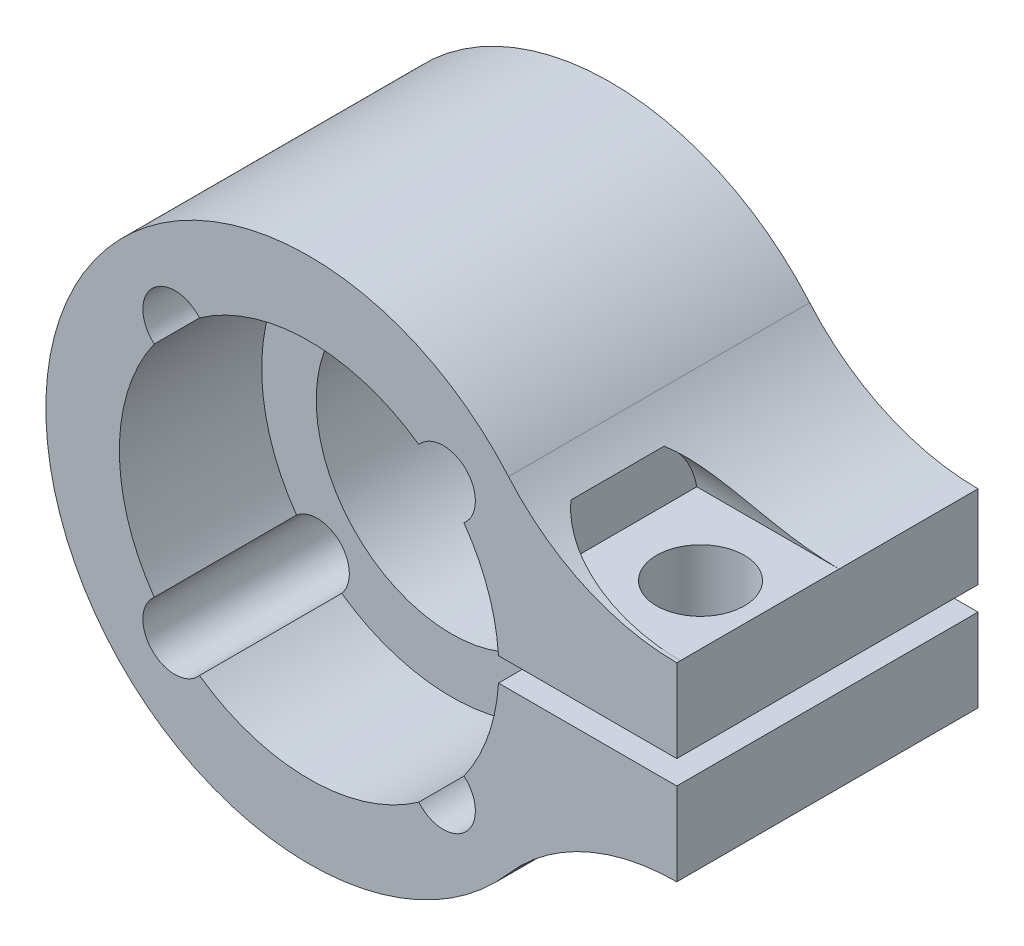
ISO-10303-21;
HEADER;
FILE_DESCRIPTION(('STEP AP214'),'2;1');
FILE_NAME('part.step','',(''),(''),'','','');
FILE_SCHEMA(('AUTOMOTIVE_DESIGN { 1 0 10303 214 1 1 1 1 }'));
ENDSEC;
DATA;
#1=APPLICATION_CONTEXT('core data for automotive mechanical design processes');
#2=APPLICATION_PROTOCOL_DEFINITION('international standard','automotive_design',2000,#1);
#3=PRODUCT_CONTEXT('',#1,'mechanical');
#4=PRODUCT('Part','Part','',(#3));
#5=PRODUCT_RELATED_PRODUCT_CATEGORY('part','',(#4));
#6=PRODUCT_DEFINITION_FORMATION('','',#4);
#7=PRODUCT_DEFINITION_CONTEXT('part definition',#1,'design');
#8=PRODUCT_DEFINITION('design','',#6,#7);
#9=PRODUCT_DEFINITION_SHAPE('','',#8);
#10=(LENGTH_UNIT() NAMED_UNIT(*) SI_UNIT(.MILLI.,.METRE.));
#11=(NAMED_UNIT(*) PLANE_ANGLE_UNIT() SI_UNIT($,.RADIAN.));
#12=(NAMED_UNIT(*) SI_UNIT($,.STERADIAN.) SOLID_ANGLE_UNIT());
#13=UNCERTAINTY_MEASURE_WITH_UNIT(LENGTH_MEASURE(1.E-05),#10,'distance_accuracy_value','');
#14=(GEOMETRIC_REPRESENTATION_CONTEXT(3) GLOBAL_UNCERTAINTY_ASSIGNED_CONTEXT((#13)) GLOBAL_UNIT_ASSIGNED_CONTEXT((#10,
#11,#12)) REPRESENTATION_CONTEXT('',''));
#15=CARTESIAN_POINT('',(0.,0.,0.));
#16=DIRECTION('',(0.,0.,1.));
#17=DIRECTION('',(1.,0.,0.));
#18=AXIS2_PLACEMENT_3D('',#15,#16,#17);
#19=CARTESIAN_POINT('',(15.5,4.,-0.153359893863698));
#20=DIRECTION('',(0.,-1.,0.));
#21=DIRECTION('',(0.,0.,-1.));
#22=AXIS2_PLACEMENT_3D('',#19,#20,#21);
#23=PLANE('',#22);
#24=CARTESIAN_POINT('',(13.,4.,-3.5));
#25=DIRECTION('',(0.,-1.,0.));
#26=DIRECTION('',(0.,0.,-1.));
#27=AXIS2_PLACEMENT_3D('',#24,#25,#26);
#28=CIRCLE('',#27,1.85);
#29=CARTESIAN_POINT('',(13.,4.,-5.35));
#30=VERTEX_POINT('',#29);
#31=EDGE_CURVE('E18',#30,#30,#28,.T.);
#32=ORIENTED_EDGE('',*,*,#31,.T.);
#33=EDGE_LOOP('',(#32));
#34=FACE_BOUND('',#33,.T.);
#35=DIRECTION('',(0.,0.,-1.));
#36=VECTOR('',#35,1.);
#37=CARTESIAN_POINT('',(9.5,4.,0.));
#38=LINE('',#37,#36);
#39=CARTESIAN_POINT('',(9.5,4.,-0.153359893863698));
#40=VERTEX_POINT('',#39);
#41=CARTESIAN_POINT('',(9.5,4.,-6.8466401061363));
#42=VERTEX_POINT('',#41);
#43=EDGE_CURVE('E157',#40,#42,#38,.T.);
#44=ORIENTED_EDGE('',*,*,#43,.F.);
#45=DIRECTION('',(1.,0.,0.));
#46=VECTOR('',#45,1.);
#47=CARTESIAN_POINT('',(15.5,4.,-0.153359893863699));
#48=LINE('',#47,#46);
#49=CARTESIAN_POINT('',(15.5,4.,-0.153359893863698));
#50=VERTEX_POINT('',#49);
#51=EDGE_CURVE('E156',#40,#50,#48,.T.);
#52=ORIENTED_EDGE('',*,*,#51,.T.);
#53=DIRECTION('',(0.,0.,-1.));
#54=VECTOR('',#53,1.);
#55=CARTESIAN_POINT('',(15.5,4.,0.));
#56=LINE('',#55,#54);
#57=CARTESIAN_POINT('',(15.5,4.,-6.8466401061363));
#58=VERTEX_POINT('',#57);
#59=EDGE_CURVE('E373',#58,#50,#56,.F.);
#60=ORIENTED_EDGE('',*,*,#59,.F.);
#61=DIRECTION('',(1.,0.,0.));
#62=VECTOR('',#61,1.);
#63=CARTESIAN_POINT('',(15.5,4.,-6.8466401061363));
#64=LINE('',#63,#62);
#65=EDGE_CURVE('E371',#58,#42,#64,.F.);
#66=ORIENTED_EDGE('',*,*,#65,.T.);
#67=EDGE_LOOP('',(#44,#52,#60,#66));
#68=FACE_BOUND('',#67,.T.);
#69=ADVANCED_FACE('F15',(#34,#68),#23,.F.);
#70=CARTESIAN_POINT('',(0.,0.,-6.));
#71=DIRECTION('',(0.,0.,-1.));
#72=DIRECTION('',(-1.,0.,0.));
#73=AXIS2_PLACEMENT_3D('',#70,#71,#72);
#74=PLANE('',#73);
#75=CARTESIAN_POINT('',(0.,0.,-6.));
#76=DIRECTION('',(0.,0.,-1.));
#77=DIRECTION('',(-1.,0.,0.));
#78=AXIS2_PLACEMENT_3D('',#75,#76,#77);
#79=CIRCLE('',#78,8.);
#80=CARTESIAN_POINT('',(7.98435971133565,0.5,-6.));
#81=VERTEX_POINT('',#80);
#82=CARTESIAN_POINT('',(6.52895071917872,4.62307284244318,-6.));
#83=VERTEX_POINT('',#82);
#84=EDGE_CURVE('E325',#81,#83,#79,.F.);
#85=ORIENTED_EDGE('',*,*,#84,.T.);
#86=CARTESIAN_POINT('',(5.65685424949238,5.65685424949238,-6.));
#87=DIRECTION('',(0.,0.,1.));
#88=DIRECTION('',(1.,0.,0.));
#89=AXIS2_PLACEMENT_3D('',#86,#87,#88);
#90=CIRCLE('',#89,1.3525);
#91=CARTESIAN_POINT('',(4.62307284244318,6.52895071917872,-6.));
#92=VERTEX_POINT('',#91);
#93=EDGE_CURVE('E329',#83,#92,#90,.F.);
#94=ORIENTED_EDGE('',*,*,#93,.T.);
#95=CARTESIAN_POINT('',(0.,0.,-6.));
#96=DIRECTION('',(0.,0.,-1.));
#97=DIRECTION('',(-1.,0.,0.));
#98=AXIS2_PLACEMENT_3D('',#95,#96,#97);
#99=CIRCLE('',#98,8.);
#100=CARTESIAN_POINT('',(-4.62307284244318,6.52895071917872,-6.));
#101=VERTEX_POINT('',#100);
#102=EDGE_CURVE('E333',#92,#101,#99,.F.);
#103=ORIENTED_EDGE('',*,*,#102,.T.);
#104=CARTESIAN_POINT('',(-5.65685424949238,5.65685424949238,-6.));
#105=DIRECTION('',(0.,0.,1.));
#106=DIRECTION('',(1.,0.,0.));
#107=AXIS2_PLACEMENT_3D('',#104,#105,#106);
#108=CIRCLE('',#107,1.3525);
#109=CARTESIAN_POINT('',(-6.52895071917872,4.62307284244318,-6.));
#110=VERTEX_POINT('',#109);
#111=EDGE_CURVE('E341',#101,#110,#108,.F.);
#112=ORIENTED_EDGE('',*,*,#111,.T.);
#113=CARTESIAN_POINT('',(0.,0.,-6.));
#114=DIRECTION('',(0.,0.,-1.));
#115=DIRECTION('',(-1.,0.,0.));
#116=AXIS2_PLACEMENT_3D('',#113,#114,#115);
#117=CIRCLE('',#116,8.);
#118=CARTESIAN_POINT('',(-6.52895071917873,-4.62307284244317,-6.));
#119=VERTEX_POINT('',#118);
#120=EDGE_CURVE('E338',#110,#119,#117,.F.);
#121=ORIENTED_EDGE('',*,*,#120,.T.);
#122=CARTESIAN_POINT('',(-5.65685424949238,-5.65685424949235,-6.));
#123=DIRECTION('',(0.,0.,1.));
#124=DIRECTION('',(1.,0.,0.));
#125=AXIS2_PLACEMENT_3D('',#122,#123,#124);
#126=CIRCLE('',#125,1.3525);
#127=CARTESIAN_POINT('',(-4.62307284244319,-6.52895071917871,-6.));
#128=VERTEX_POINT('',#127);
#129=EDGE_CURVE('E345',#119,#128,#126,.F.);
#130=ORIENTED_EDGE('',*,*,#129,.T.);
#131=CARTESIAN_POINT('',(0.,0.,-6.));
#132=DIRECTION('',(0.,0.,-1.));
#133=DIRECTION('',(-1.,0.,0.));
#134=AXIS2_PLACEMENT_3D('',#131,#132,#133);
#135=CIRCLE('',#134,8.);
#136=CARTESIAN_POINT('',(4.6230728424432,-6.52895071917871,-6.));
#137=VERTEX_POINT('',#136);
#138=EDGE_CURVE('E349',#128,#137,#135,.F.);
#139=ORIENTED_EDGE('',*,*,#138,.T.);
#140=CARTESIAN_POINT('',(5.65685424949238,-5.65685424949236,-6.));
#141=DIRECTION('',(0.,0.,1.));
#142=DIRECTION('',(1.,0.,0.));
#143=AXIS2_PLACEMENT_3D('',#140,#141,#142);
#144=CIRCLE('',#143,1.3525);
#145=CARTESIAN_POINT('',(6.52895071917873,-4.62307284244316,-6.));
#146=VERTEX_POINT('',#145);
#147=EDGE_CURVE('E440',#137,#146,#144,.F.);
#148=ORIENTED_EDGE('',*,*,#147,.T.);
#149=CARTESIAN_POINT('',(0.,0.,-6.));
#150=DIRECTION('',(0.,0.,-1.));
#151=DIRECTION('',(-1.,0.,0.));
#152=AXIS2_PLACEMENT_3D('',#149,#150,#151);
#153=CIRCLE('',#152,8.);
#154=CARTESIAN_POINT('',(7.98435971133566,-0.499999999999998,-6.));
#155=VERTEX_POINT('',#154);
#156=EDGE_CURVE('E357',#146,#155,#153,.F.);
#157=ORIENTED_EDGE('',*,*,#156,.T.);
#158=DIRECTION('',(1.,0.,0.));
#159=VECTOR('',#158,1.);
#160=CARTESIAN_POINT('',(0.,-0.5,-6.));
#161=LINE('',#160,#159);
#162=CARTESIAN_POINT('',(5.67802782663136,-0.5,-6.));
#163=VERTEX_POINT('',#162);
#164=EDGE_CURVE('E368',#155,#163,#161,.F.);
#165=ORIENTED_EDGE('',*,*,#164,.T.);
#166=CARTESIAN_POINT('',(0.,0.,-6.));
#167=DIRECTION('',(0.,0.,-1.));
#168=DIRECTION('',(-1.,0.,0.));
#169=AXIS2_PLACEMENT_3D('',#166,#167,#168);
#170=CIRCLE('',#169,5.7);
#171=CARTESIAN_POINT('',(5.67802782663136,0.5,-6.));
#172=VERTEX_POINT('',#171);
#173=EDGE_CURVE('E375',#163,#172,#170,.T.);
#174=ORIENTED_EDGE('',*,*,#173,.T.);
#175=DIRECTION('',(1.,0.,0.));
#176=VECTOR('',#175,1.);
#177=CARTESIAN_POINT('',(15.5,0.5,-6.));
#178=LINE('',#177,#176);
#179=EDGE_CURVE('E316',#172,#81,#178,.T.);
#180=ORIENTED_EDGE('',*,*,#179,.T.);
#181=EDGE_LOOP('',(#85,#94,#103,#112,#121,#130,#139,#148,#157,#165,#174,#180));
#182=FACE_BOUND('',#181,.T.);
#183=ADVANCED_FACE('F500',(#182),#74,.F.);
#184=CARTESIAN_POINT('',(13.,4.,-3.5));
#185=DIRECTION('',(0.,-1.,0.));
#186=DIRECTION('',(0.,0.,-1.));
#187=AXIS2_PLACEMENT_3D('',#184,#185,#186);
#188=CYLINDRICAL_SURFACE('',#187,1.85);
#189=ORIENTED_EDGE('',*,*,#31,.F.);
#190=EDGE_LOOP('',(#189));
#191=FACE_BOUND('',#190,.T.);
#192=CARTESIAN_POINT('',(13.,0.5,-3.5));
#193=DIRECTION('',(0.,-1.,0.));
#194=DIRECTION('',(0.,0.,-1.));
#195=AXIS2_PLACEMENT_3D('',#192,#193,#194);
#196=CIRCLE('',#195,1.85);
#197=CARTESIAN_POINT('',(13.,0.5,-5.35));
#198=VERTEX_POINT('',#197);
#199=EDGE_CURVE('E150',#198,#198,#196,.T.);
#200=ORIENTED_EDGE('',*,*,#199,.T.);
#201=EDGE_LOOP('',(#200));
#202=FACE_BOUND('',#201,.T.);
#203=ADVANCED_FACE('F532',(#191,#202),#188,.F.);
#204=CARTESIAN_POINT('',(9.5,0.,0.));
#205=DIRECTION('',(1.,0.,0.));
#206=DIRECTION('',(0.,0.,-1.));
#207=AXIS2_PLACEMENT_3D('',#204,#205,#206);
#208=PLANE('',#207);
#209=CARTESIAN_POINT('',(9.5,3.4,-3.5));
#210=DIRECTION('',(1.,0.,0.));
#211=DIRECTION('',(0.,0.,-1.));
#212=AXIS2_PLACEMENT_3D('',#209,#210,#211);
#213=CIRCLE('',#212,3.4);
#214=CARTESIAN_POINT('',(9.5,6.17329140254581,-5.46694046594336));
#215=VERTEX_POINT('',#214);
#216=EDGE_CURVE('E144',#42,#215,#213,.T.);
#217=ORIENTED_EDGE('',*,*,#216,.T.);
#218=DIRECTION('',(0.,0.,1.));
#219=VECTOR('',#218,1.);
#220=CARTESIAN_POINT('',(9.5,6.17329140254581,0.));
#221=LINE('',#220,#219);
#222=CARTESIAN_POINT('',(9.5,6.17329140254581,-1.53305953405664));
#223=VERTEX_POINT('',#222);
#224=EDGE_CURVE('E137',#215,#223,#221,.T.);
#225=ORIENTED_EDGE('',*,*,#224,.T.);
#226=CARTESIAN_POINT('',(9.5,3.4,-3.5));
#227=DIRECTION('',(1.,0.,0.));
#228=DIRECTION('',(0.,0.,-1.));
#229=AXIS2_PLACEMENT_3D('',#226,#227,#228);
#230=CIRCLE('',#229,3.4);
#231=EDGE_CURVE('E141',#223,#40,#230,.T.);
#232=ORIENTED_EDGE('',*,*,#231,.T.);
#233=ORIENTED_EDGE('',*,*,#43,.T.);
#234=EDGE_LOOP('',(#217,#225,#232,#233));
#235=FACE_BOUND('',#234,.T.);
#236=ADVANCED_FACE('F139',(#235),#208,.T.);
#237=CARTESIAN_POINT('',(15.5,3.4,-3.5));
#238=DIRECTION('',(1.,0.,0.));
#239=DIRECTION('',(0.,0.,-1.));
#240=AXIS2_PLACEMENT_3D('',#237,#238,#239);
#241=CYLINDRICAL_SURFACE('',#240,3.4);
#242=ORIENTED_EDGE('',*,*,#231,.F.);
#243=CARTESIAN_POINT('',(9.5,6.17329140254581,-1.53305953405664));
#244=CARTESIAN_POINT('',(9.56622666367506,6.1180370137351,-1.45516119273621));
#245=CARTESIAN_POINT('',(9.63634146561112,6.06115417885216,-1.38190337240648));
#246=CARTESIAN_POINT('',(9.78327810280236,5.94566598238026,-1.2444226729533));
#247=CARTESIAN_POINT('',(9.86008419473697,5.88706486833966,-1.18017946753182));
#248=CARTESIAN_POINT('',(10.01856117319,5.77020829173325,-1.06094475951216));
#249=CARTESIAN_POINT('',(10.1001517025144,5.71195896536238,-1.00583932704308));
#250=CARTESIAN_POINT('',(10.2684068362733,5.59602862932096,-0.903183570747598));
#251=CARTESIAN_POINT('',(10.3550749385378,5.53834804417481,-0.855638540890687));
#252=CARTESIAN_POINT('',(10.5668799136074,5.40258133782906,-0.750524754239648));
#253=CARTESIAN_POINT('',(10.6940132020044,5.32516131815498,-0.696113782066285));
#254=CARTESIAN_POINT('',(10.9550633284025,5.17482725411202,-0.59861807645784));
#255=CARTESIAN_POINT('',(11.0889818273237,5.10191432280388,-0.555536132334565));
#256=CARTESIAN_POINT('',(11.3632757999144,4.96128847829368,-0.478602003828317));
#257=CARTESIAN_POINT('',(11.5036886833969,4.89361389012478,-0.444813929045045));
#258=CARTESIAN_POINT('',(11.7891341195239,4.76480306162023,-0.385141295826784));
#259=CARTESIAN_POINT('',(11.9341681798831,4.70366898414937,-0.359259346631422));
#260=CARTESIAN_POINT('',(12.2986134627044,4.56083144938514,-0.302984980849128));
#261=CARTESIAN_POINT('',(12.5202810259395,4.48335693299542,-0.276399783243145));
#262=CARTESIAN_POINT('',(12.9697511710119,4.34506614412722,-0.233184220397528));
#263=CARTESIAN_POINT('',(13.1975570155676,4.28425893072072,-0.216559262985745));
#264=CARTESIAN_POINT('',(13.6570039926271,4.18004396309455,-0.190255171511903));
#265=CARTESIAN_POINT('',(13.8886365279865,4.13660159772971,-0.180562190066223));
#266=CARTESIAN_POINT('',(14.35454103967,4.06730588084742,-0.165939197459909));
#267=CARTESIAN_POINT('',(14.5888113881983,4.04144222779836,-0.16100639601097));
#268=CARTESIAN_POINT('',(14.9363093135263,4.01629057264586,-0.156313175953792));
#269=CARTESIAN_POINT('',(15.0490640724916,4.01017695150985,-0.155196925767486));
#270=CARTESIAN_POINT('',(15.2745423088303,4.00203504356606,-0.153723780945169));
#271=CARTESIAN_POINT('',(15.3872655386453,4.00000012637955,-0.153365653843966));
#272=CARTESIAN_POINT('',(15.5,4.,-0.153359893863699));
#273=B_SPLINE_CURVE_WITH_KNOTS('',3,(#243,#244,#245,#246,#247,#248,#249,#250,#251,#252,#253,
#254,#255,#256,#257,#258,#259,#260,#261,#262,#263,#264,#265,#266,#267,#268,#269,#270,#271,#272),
.UNSPECIFIED.,.F.,.F.,(4,2,2,2,2,2,2,2,2,2,2,2,2,2,4),(0.,0.348320084948596,0.695841697919728,
1.03863752006757,1.38167232875746,1.85638193496899,2.33120830988997,2.8092322997522,
3.28741388070165,3.99533511768048,4.70364036698011,5.41052671623478,6.11699845575185,
6.45571140375601,6.79387328884464),.UNSPECIFIED.);
#274=EDGE_CURVE('E149',#223,#50,#273,.T.);
#275=ORIENTED_EDGE('',*,*,#274,.T.);
#276=ORIENTED_EDGE('',*,*,#51,.F.);
#277=EDGE_LOOP('',(#242,#275,#276));
#278=FACE_BOUND('',#277,.T.);
#279=ADVANCED_FACE('F154',(#278),#241,.F.);
#280=CARTESIAN_POINT('',(15.5,3.4,-3.5));
#281=DIRECTION('',(1.,0.,0.));
#282=DIRECTION('',(0.,0.,-1.));
#283=AXIS2_PLACEMENT_3D('',#280,#281,#282);
#284=CYLINDRICAL_SURFACE('',#283,3.4);
#285=ORIENTED_EDGE('',*,*,#65,.F.);
#286=CARTESIAN_POINT('',(15.5,4.,-6.8466401061363));
#287=CARTESIAN_POINT('',(15.3721209354606,3.99999836614933,-6.84662699427896));
#288=CARTESIAN_POINT('',(15.2442424329338,4.00261816108707,-6.84617035562876));
#289=CARTESIAN_POINT('',(14.9887027067511,4.01308839698554,-6.84427488862197));
#290=CARTESIAN_POINT('',(14.8610414907553,4.02093901867662,-6.84283602632852));
#291=CARTESIAN_POINT('',(14.6060004214515,4.04187190422195,-6.83887846633403));
#292=CARTESIAN_POINT('',(14.4786211270598,4.05496076237583,-6.83635840724919));
#293=CARTESIAN_POINT('',(14.2245465948605,4.08634024433905,-6.83004329153262));
#294=CARTESIAN_POINT('',(14.0978513483146,4.10463080153876,-6.82624825122739));
#295=CARTESIAN_POINT('',(13.7169461526605,4.16761589278196,-6.81250253149486));
#296=CARTESIAN_POINT('',(13.464079174232,4.22024671676132,-6.80021656649174));
#297=CARTESIAN_POINT('',(12.9642784207183,4.34599602845493,-6.76639493067401));
#298=CARTESIAN_POINT('',(12.7173402806896,4.41909890860314,-6.74486629968021));
#299=CARTESIAN_POINT('',(12.3231417054624,4.55359435234661,-6.69877626146279));
#300=CARTESIAN_POINT('',(12.173342404943,4.60904051046875,-6.67840524745653));
#301=CARTESIAN_POINT('',(11.8776571631958,4.7271172803077,-6.63094524687411));
#302=CARTESIAN_POINT('',(11.7317712266421,4.789747900605,-6.60385625227452));
#303=CARTESIAN_POINT('',(11.4451744942026,4.92143318619287,-6.54146918415442));
#304=CARTESIAN_POINT('',(11.304451461278,4.99047107957002,-6.50619219931267));
#305=CARTESIAN_POINT('',(11.0288960868217,5.13422404140029,-6.42562053835278));
#306=CARTESIAN_POINT('',(10.8940615858609,5.20893700070036,-6.38032957211419));
#307=CARTESIAN_POINT('',(10.6682267665243,5.34128459557217,-6.2921044985007));
#308=CARTESIAN_POINT('',(10.5754894482143,5.39787063710786,-6.25203619375728));
#309=CARTESIAN_POINT('',(10.3943846790257,5.51264115544297,-6.1649456969981));
#310=CARTESIAN_POINT('',(10.3060158651095,5.57082512473834,-6.11792569252273));
#311=CARTESIAN_POINT('',(10.1345945037201,5.68776538084598,-6.01636790700628));
#312=CARTESIAN_POINT('',(10.0515259596536,5.74651926238313,-5.96185448247536));
#313=CARTESIAN_POINT('',(9.89122528628696,5.86368851927857,-5.8445892248529));
#314=CARTESIAN_POINT('',(9.81398881962915,5.92210411576424,-5.78184361109731));
#315=CARTESIAN_POINT('',(9.69780275336702,6.01266892797868,-5.67635517403291));
#316=CARTESIAN_POINT('',(9.65660722876362,6.04536586181598,-5.63653590341939));
#317=CARTESIAN_POINT('',(9.57652143882167,6.10998632758242,-5.55395367778147));
#318=CARTESIAN_POINT('',(9.53763353321789,6.14190904874682,-5.51118780296505));
#319=CARTESIAN_POINT('',(9.5,6.17329140254581,-5.46694046594336));
#320=B_SPLINE_CURVE_WITH_KNOTS('',3,(#286,#287,#288,#289,#290,#291,#292,#293,#294,#295,#296,
#297,#298,#299,#300,#301,#302,#303,#304,#305,#306,#307,#308,#309,#310,#311,#312,#313,#314,#315,
#316,#317,#318,#319),.UNSPECIFIED.,.F.,.F.,(4,2,2,2,2,2,2,2,2,2,2,2,2,2,2,2,4),(0.,
0.38360823544799,0.767229725635002,1.15133567519486,1.53543670636032,2.31012694919665,
3.08422818104018,3.56700819759537,4.04978879074704,4.53133948592135,5.01271207904688,
5.35982642537374,5.70683177435358,6.05273477854164,6.39837794532244,6.59618069047003,
6.79418233842388),.UNSPECIFIED.);
#321=EDGE_CURVE('E173',#58,#215,#320,.T.);
#322=ORIENTED_EDGE('',*,*,#321,.T.);
#323=ORIENTED_EDGE('',*,*,#216,.F.);
#324=EDGE_LOOP('',(#285,#322,#323));
#325=FACE_BOUND('',#324,.T.);
#326=ADVANCED_FACE('F515',(#325),#284,.F.);
#327=CARTESIAN_POINT('',(0.,0.,0.));
#328=DIRECTION('',(0.,0.,-1.));
#329=DIRECTION('',(-1.,0.,0.));
#330=AXIS2_PLACEMENT_3D('',#327,#328,#329);
#331=CYLINDRICAL_SURFACE('',#330,5.7);
#332=ORIENTED_EDGE('',*,*,#173,.F.);
#333=DIRECTION('',(0.,0.,-1.));
#334=VECTOR('',#333,1.);
#335=CARTESIAN_POINT('',(5.67802782663136,-0.5,0.));
#336=LINE('',#335,#334);
#337=CARTESIAN_POINT('',(5.67802782663136,-0.5,-12.7));
#338=VERTEX_POINT('',#337);
#339=EDGE_CURVE('E361',#163,#338,#336,.T.);
#340=ORIENTED_EDGE('',*,*,#339,.T.);
#341=CARTESIAN_POINT('',(0.,0.,-12.7));
#342=DIRECTION('',(0.,0.,-1.));
#343=DIRECTION('',(-1.,0.,0.));
#344=AXIS2_PLACEMENT_3D('',#341,#342,#343);
#345=CIRCLE('',#344,5.7);
#346=CARTESIAN_POINT('',(5.67802782663136,0.5,-12.7));
#347=VERTEX_POINT('',#346);
#348=EDGE_CURVE('E292',#338,#347,#345,.T.);
#349=ORIENTED_EDGE('',*,*,#348,.T.);
#350=DIRECTION('',(0.,0.,1.));
#351=VECTOR('',#350,1.);
#352=CARTESIAN_POINT('',(5.67802782663136,0.5,0.));
#353=LINE('',#352,#351);
#354=EDGE_CURVE('E319',#347,#172,#353,.T.);
#355=ORIENTED_EDGE('',*,*,#354,.T.);
#356=EDGE_LOOP('',(#332,#340,#349,#355));
#357=FACE_BOUND('',#356,.T.);
#358=ADVANCED_FACE('F245',(#357),#331,.F.);
#359=CARTESIAN_POINT('',(13.,13.3211419426689,-3.5));
#360=DIRECTION('',(0.,-1.,0.));
#361=DIRECTION('',(0.,0.,-1.));
#362=AXIS2_PLACEMENT_3D('',#359,#360,#361);
#363=CYLINDRICAL_SURFACE('',#362,1.3525);
#364=CARTESIAN_POINT('',(13.,-0.500000000000004,-3.5));
#365=DIRECTION('',(0.,-1.,0.));
#366=DIRECTION('',(0.,0.,-1.));
#367=AXIS2_PLACEMENT_3D('',#364,#365,#366);
#368=CIRCLE('',#367,1.3525);
#369=CARTESIAN_POINT('',(13.,-0.500000000000004,-4.8525));
#370=VERTEX_POINT('',#369);
#371=EDGE_CURVE('E354',#370,#370,#368,.F.);
#372=ORIENTED_EDGE('',*,*,#371,.T.);
#373=EDGE_LOOP('',(#372));
#374=FACE_BOUND('',#373,.T.);
#375=CARTESIAN_POINT('',(11.6475,-4.82871732937661,-3.5));
#376=CARTESIAN_POINT('',(11.6475034599815,-4.82871507066379,-3.57145671624073));
#377=CARTESIAN_POINT('',(11.6531957042373,-4.82614098289229,-3.64302050973882));
#378=CARTESIAN_POINT('',(11.6757392322921,-4.81602627116469,-3.78410535595577));
#379=CARTESIAN_POINT('',(11.6926162785328,-4.80847418137633,-3.85362130478122));
#380=CARTESIAN_POINT('',(11.7367631846431,-4.78897627307936,-3.98836154489463));
#381=CARTESIAN_POINT('',(11.7640000735603,-4.77704439772467,-4.05359868940075));
#382=CARTESIAN_POINT('',(11.8278552570997,-4.74956046510891,-4.17841764548216));
#383=CARTESIAN_POINT('',(11.8644710074274,-4.73400938976765,-4.23800098482168));
#384=CARTESIAN_POINT('',(11.9477698942884,-4.69940025823488,-4.35283043012584));
#385=CARTESIAN_POINT('',(11.9948280842834,-4.68021707265137,-4.40776615741642));
#386=CARTESIAN_POINT('',(12.0966258620103,-4.63984074712307,-4.50912637072183));
#387=CARTESIAN_POINT('',(12.1513685369098,-4.61864680048912,-4.55554741867201));
#388=CARTESIAN_POINT('',(12.271713567959,-4.57350229438601,-4.64226634690181));
#389=CARTESIAN_POINT('',(12.3378291540233,-4.54946548417537,-4.6818085957491));
#390=CARTESIAN_POINT('',(12.4757555202558,-4.5012235666882,-4.74912613729112));
#391=CARTESIAN_POINT('',(12.5475677410698,-4.47701841826096,-4.77689844210058));
#392=CARTESIAN_POINT('',(12.6978141122125,-4.42850916669496,-4.82071279551382));
#393=CARTESIAN_POINT('',(12.7763944196894,-4.40423385541487,-4.83628840167936));
#394=CARTESIAN_POINT('',(12.9355811285225,-4.35740710535676,-4.85333367508506));
#395=CARTESIAN_POINT('',(13.0161873690931,-4.33485553034696,-4.85480445821542));
#396=CARTESIAN_POINT('',(13.1756495806501,-4.29253295608661,-4.84338484293308));
#397=CARTESIAN_POINT('',(13.254511981942,-4.27272114549246,-4.83073857869036));
#398=CARTESIAN_POINT('',(13.4093789023109,-4.2358841747187,-4.79152645293335));
#399=CARTESIAN_POINT('',(13.4853840794474,-4.21885836981569,-4.76496381787075));
#400=CARTESIAN_POINT('',(13.6290410663387,-4.18843015752556,-4.69980630834167));
#401=CARTESIAN_POINT('',(13.6969052372331,-4.17491021964473,-4.66173419688788));
#402=CARTESIAN_POINT('',(13.8254180271169,-4.15063674255099,-4.57423469388232));
#403=CARTESIAN_POINT('',(13.8860683900674,-4.13988253398053,-4.52481005534387));
#404=CARTESIAN_POINT('',(13.996503354583,-4.12125891356802,-4.4175991878207));
#405=CARTESIAN_POINT('',(14.0465533980269,-4.11331447377704,-4.36009906610772));
#406=CARTESIAN_POINT('',(14.1364064410711,-4.09965001382684,-4.23730862757265));
#407=CARTESIAN_POINT('',(14.1762057125733,-4.09393080257485,-4.17201548911038));
#408=CARTESIAN_POINT('',(14.2439496608937,-4.08451489846135,-4.03623673394911));
#409=CARTESIAN_POINT('',(14.2720074661536,-4.080798800368,-3.96580872808343));
#410=CARTESIAN_POINT('',(14.3159466483655,-4.07509455195872,-3.8212862840935));
#411=CARTESIAN_POINT('',(14.3318517336439,-4.07310303619611,-3.7471992864999));
#412=CARTESIAN_POINT('',(14.3451433662488,-4.07144776156596,-3.64380384355864));
#413=CARTESIAN_POINT('',(14.3478998504171,-4.07110605494019,-3.61511727344711));
#414=CARTESIAN_POINT('',(14.3515788283893,-4.07065094705604,-3.55762491210632));
#415=CARTESIAN_POINT('',(14.3525013205296,-4.07053754600476,-3.52881912076894));
#416=CARTESIAN_POINT('',(14.3524965476717,-4.07053701569374,-3.4246566949363));
#417=CARTESIAN_POINT('',(14.3461789904108,-4.07131070647412,-3.34922228543952));
#418=CARTESIAN_POINT('',(14.3210628269425,-4.07446265122424,-3.20039327574453));
#419=CARTESIAN_POINT('',(14.3022400177588,-4.07684401687275,-3.12700291921268));
#420=CARTESIAN_POINT('',(14.2526748104019,-4.08336786037678,-2.98449540371864));
#421=CARTESIAN_POINT('',(14.2219413194993,-4.08750902241101,-2.91537509612747));
#422=CARTESIAN_POINT('',(14.1494970838452,-4.09777370013443,-2.78335440966279));
#423=CARTESIAN_POINT('',(14.1077912124593,-4.10389633603224,-2.72045128645721));
#424=CARTESIAN_POINT('',(14.0146583719644,-4.11837089087105,-2.60257740741252));
#425=CARTESIAN_POINT('',(13.9632291064848,-4.1267233366179,-2.54760853082071));
#426=CARTESIAN_POINT('',(13.8522353164536,-4.14586595785129,-2.44711993416409));
#427=CARTESIAN_POINT('',(13.7926702576707,-4.15665629345069,-2.4016008351076));
#428=CARTESIAN_POINT('',(13.6669256324939,-4.18084909945122,-2.32098726363999));
#429=CARTESIAN_POINT('',(13.600715429921,-4.1942639670038,-2.28594434388355));
#430=CARTESIAN_POINT('',(13.4639208627694,-4.22364924180571,-2.22737623073849));
#431=CARTESIAN_POINT('',(13.393336230163,-4.23961980574137,-2.20385174388879));
#432=CARTESIAN_POINT('',(13.2484727723733,-4.27425206806742,-2.16839101075985));
#433=CARTESIAN_POINT('',(13.1741494315897,-4.29295873971171,-2.15668108445279));
#434=CARTESIAN_POINT('',(13.0251418186438,-4.33245241341986,-2.14567031001681));
#435=CARTESIAN_POINT('',(12.9504574835378,-4.35323979172063,-2.14637171017016));
#436=CARTESIAN_POINT('',(12.800003467832,-4.3971246348299,-2.16016169115785));
#437=CARTESIAN_POINT('',(12.7242908134809,-4.42027819021012,-2.17369330615998));
#438=CARTESIAN_POINT('',(12.5764821148355,-4.467469576193,-2.21324211290727));
#439=CARTESIAN_POINT('',(12.5043869930861,-4.49150762967892,-2.23926247184235));
#440=CARTESIAN_POINT('',(12.3631177247077,-4.54041401839354,-2.30421828605231));
#441=CARTESIAN_POINT('',(12.2941391364694,-4.56528142476058,-2.34358081787066));
#442=CARTESIAN_POINT('',(12.1638299971723,-4.61383072395662,-2.43399577349396));
#443=CARTESIAN_POINT('',(12.1024999443178,-4.63751253949948,-2.48504895818173));
#444=CARTESIAN_POINT('',(11.9894095342552,-4.68236460817006,-2.59760506847965));
#445=CARTESIAN_POINT('',(11.9376333392148,-4.70353899669953,-2.65909036947088));
#446=CARTESIAN_POINT('',(11.8453425592463,-4.74205548633347,-2.79112605466135));
#447=CARTESIAN_POINT('',(11.8048288175005,-4.75939730048597,-2.86167711700601));
#448=CARTESIAN_POINT('',(11.7388728158288,-4.78801370629662,-3.00534162227183));
#449=CARTESIAN_POINT('',(11.7126713422906,-4.79959020302373,-3.07804650162571));
#450=CARTESIAN_POINT('',(11.6730270666699,-4.81721981803328,-3.22736559372366));
#451=CARTESIAN_POINT('',(11.6595461211872,-4.82328944692721,-3.30396738853035));
#452=CARTESIAN_POINT('',(11.6509890039228,-4.82714431657247,-3.40089338575988));
#453=CARTESIAN_POINT('',(11.6496819029923,-4.82773336872009,-3.42068508577083));
#454=CARTESIAN_POINT('',(11.6479369164459,-4.828520190635,-3.46031510354803));
#455=CARTESIAN_POINT('',(11.6474990390155,-4.82871795671751,-3.48015342175154));
#456=CARTESIAN_POINT('',(11.6475,-4.82871732937661,-3.5));
#457=B_SPLINE_CURVE_WITH_KNOTS('',3,(#375,#376,#377,#378,#379,#380,#381,#382,#383,#384,#385,
#386,#387,#388,#389,#390,#391,#392,#393,#394,#395,#396,#397,#398,#399,#400,#401,#402,#403,#404,
#405,#406,#407,#408,#409,#410,#411,#412,#413,#414,#415,#416,#417,#418,#419,#420,#421,#422,#423,
#424,#425,#426,#427,#428,#429,#430,#431,#432,#433,#434,#435,#436,#437,#438,#439,#440,#441,#442,
#443,#444,#445,#446,#447,#448,#449,#450,#451,#452,#453,#454,#455,#456),.UNSPECIFIED.,.T.,.F.,(4,
2,2,2,2,2,2,2,2,2,2,2,2,2,2,2,2,2,2,2,2,2,2,2,2,2,2,2,2,2,2,2,2,2,2,2,2,2,2,2,4),(0.,
0.214289499089756,0.429074304020119,0.643181184042995,0.857230042622488,1.08079034532137,
1.30444071962761,1.54546208633353,1.78654460145659,2.03644920203891,2.28633403148406,
2.53196350027794,2.77753604610381,3.01330350310327,3.24901384621484,3.47784548354904,
3.70676022740704,3.93341556798059,4.15962759738141,4.24604340597299,4.3324592929467,
4.55838077704789,4.78474079400423,5.01093185578719,5.23702262427028,5.46316685538566,
5.68932594325519,5.916580289476,6.14384857369805,6.37539217200453,6.60697771431242,
6.8468628800761,7.08680891374202,7.33530301902118,7.5838133020677,7.83190784359971,
8.0800209541426,8.31322845889802,8.54573443126344,8.60525120569119,8.66476854059335),.UNSPECIFIED.);
#458=CARTESIAN_POINT('',(11.6475,-4.82871732937661,-3.5));
#459=VERTEX_POINT('',#458);
#460=EDGE_CURVE('E248',#459,#459,#457,.T.);
#461=ORIENTED_EDGE('',*,*,#460,.T.);
#462=EDGE_LOOP('',(#461));
#463=FACE_BOUND('',#462,.T.);
#464=ADVANCED_FACE('F240',(#374,#463),#363,.F.);
#465=CARTESIAN_POINT('',(15.5,-4.,0.));
#466=DIRECTION('',(1.,0.,0.));
#467=DIRECTION('',(0.,0.,-1.));
#468=AXIS2_PLACEMENT_3D('',#465,#466,#467);
#469=PLANE('',#468);
#470=DIRECTION('',(0.,1.,0.));
#471=VECTOR('',#470,1.);
#472=CARTESIAN_POINT('',(15.5,0.,-12.7));
#473=LINE('',#472,#471);
#474=CARTESIAN_POINT('',(15.5,0.5,-12.7));
#475=VERTEX_POINT('',#474);
#476=CARTESIAN_POINT('',(15.5,4.,-12.7));
#477=VERTEX_POINT('',#476);
#478=EDGE_CURVE('E301',#475,#477,#473,.T.);
#479=ORIENTED_EDGE('',*,*,#478,.T.);
#480=DIRECTION('',(0.,0.,1.));
#481=VECTOR('',#480,1.);
#482=CARTESIAN_POINT('',(15.5,4.,0.));
#483=LINE('',#482,#481);
#484=EDGE_CURVE('E164',#477,#58,#483,.T.);
#485=ORIENTED_EDGE('',*,*,#484,.T.);
#486=ORIENTED_EDGE('',*,*,#59,.T.);
#487=DIRECTION('',(0.,0.,1.));
#488=VECTOR('',#487,1.);
#489=CARTESIAN_POINT('',(15.5,4.,0.));
#490=LINE('',#489,#488);
#491=CARTESIAN_POINT('',(15.5,4.,0.));
#492=VERTEX_POINT('',#491);
#493=EDGE_CURVE('E162',#50,#492,#490,.T.);
#494=ORIENTED_EDGE('',*,*,#493,.T.);
#495=DIRECTION('',(0.,1.,0.));
#496=VECTOR('',#495,1.);
#497=CARTESIAN_POINT('',(15.5,0.,0.));
#498=LINE('',#497,#496);
#499=CARTESIAN_POINT('',(15.5,0.5,0.));
#500=VERTEX_POINT('',#499);
#501=EDGE_CURVE('E254',#500,#492,#498,.T.);
#502=ORIENTED_EDGE('',*,*,#501,.F.);
#503=DIRECTION('',(0.,0.,1.));
#504=VECTOR('',#503,1.);
#505=CARTESIAN_POINT('',(15.5,0.5,0.));
#506=LINE('',#505,#504);
#507=EDGE_CURVE('E315',#500,#475,#506,.F.);
#508=ORIENTED_EDGE('',*,*,#507,.T.);
#509=EDGE_LOOP('',(#479,#485,#486,#494,#502,#508));
#510=FACE_BOUND('',#509,.T.);
#511=ADVANCED_FACE('F236',(#510),#469,.T.);
#512=CARTESIAN_POINT('',(15.5,-4.,0.));
#513=DIRECTION('',(1.,0.,0.));
#514=DIRECTION('',(0.,0.,-1.));
#515=AXIS2_PLACEMENT_3D('',#512,#513,#514);
#516=PLANE('',#515);
#517=DIRECTION('',(0.,1.,0.));
#518=VECTOR('',#517,1.);
#519=CARTESIAN_POINT('',(15.5,0.,-12.7));
#520=LINE('',#519,#518);
#521=CARTESIAN_POINT('',(15.5,-4.,-12.7));
#522=VERTEX_POINT('',#521);
#523=CARTESIAN_POINT('',(15.5,-0.5,-12.7));
#524=VERTEX_POINT('',#523);
#525=EDGE_CURVE('E293',#522,#524,#520,.T.);
#526=ORIENTED_EDGE('',*,*,#525,.T.);
#527=DIRECTION('',(0.,0.,-1.));
#528=VECTOR('',#527,1.);
#529=CARTESIAN_POINT('',(15.5,-0.5,0.));
#530=LINE('',#529,#528);
#531=CARTESIAN_POINT('',(15.5,-0.5,0.));
#532=VERTEX_POINT('',#531);
#533=EDGE_CURVE('E358',#524,#532,#530,.F.);
#534=ORIENTED_EDGE('',*,*,#533,.T.);
#535=DIRECTION('',(0.,1.,0.));
#536=VECTOR('',#535,1.);
#537=CARTESIAN_POINT('',(15.5,0.,0.));
#538=LINE('',#537,#536);
#539=CARTESIAN_POINT('',(15.5,-4.,0.));
#540=VERTEX_POINT('',#539);
#541=EDGE_CURVE('E405',#540,#532,#538,.T.);
#542=ORIENTED_EDGE('',*,*,#541,.F.);
#543=DIRECTION('',(0.,0.,1.));
#544=VECTOR('',#543,1.);
#545=CARTESIAN_POINT('',(15.5,-4.,0.));
#546=LINE('',#545,#544);
#547=EDGE_CURVE('E364',#540,#522,#546,.F.);
#548=ORIENTED_EDGE('',*,*,#547,.T.);
#549=EDGE_LOOP('',(#526,#534,#542,#548));
#550=FACE_BOUND('',#549,.T.);
#551=ADVANCED_FACE('F232',(#550),#516,.T.);
#552=CARTESIAN_POINT('',(0.,-0.5,0.));
#553=DIRECTION('',(0.,-1.,0.));
#554=DIRECTION('',(0.,0.,-1.));
#555=AXIS2_PLACEMENT_3D('',#552,#553,#554);
#556=PLANE('',#555);
#557=ORIENTED_EDGE('',*,*,#371,.F.);
#558=EDGE_LOOP('',(#557));
#559=FACE_BOUND('',#558,.T.);
#560=DIRECTION('',(1.,0.,0.));
#561=VECTOR('',#560,1.);
#562=CARTESIAN_POINT('',(0.,-0.5,0.));
#563=LINE('',#562,#561);
#564=CARTESIAN_POINT('',(7.98435971133566,-0.499999999999998,0.));
#565=VERTEX_POINT('',#564);
#566=EDGE_CURVE('E404',#532,#565,#563,.F.);
#567=ORIENTED_EDGE('',*,*,#566,.F.);
#568=ORIENTED_EDGE('',*,*,#533,.F.);
#569=DIRECTION('',(1.,0.,0.));
#570=VECTOR('',#569,1.);
#571=CARTESIAN_POINT('',(0.,-0.5,-12.7));
#572=LINE('',#571,#570);
#573=EDGE_CURVE('E289',#524,#338,#572,.F.);
#574=ORIENTED_EDGE('',*,*,#573,.T.);
#575=ORIENTED_EDGE('',*,*,#339,.F.);
#576=ORIENTED_EDGE('',*,*,#164,.F.);
#577=DIRECTION('',(0.,0.,-1.));
#578=VECTOR('',#577,1.);
#579=CARTESIAN_POINT('',(7.98435971133566,-0.499999999999996,0.));
#580=LINE('',#579,#578);
#581=EDGE_CURVE('E350',#155,#565,#580,.F.);
#582=ORIENTED_EDGE('',*,*,#581,.T.);
#583=EDGE_LOOP('',(#567,#568,#574,#575,#576,#582));
#584=FACE_BOUND('',#583,.T.);
#585=ADVANCED_FACE('F228',(#559,#584),#556,.F.);
#586=CARTESIAN_POINT('',(0.,0.,0.));
#587=DIRECTION('',(0.,0.,-1.));
#588=DIRECTION('',(-1.,0.,0.));
#589=AXIS2_PLACEMENT_3D('',#586,#587,#588);
#590=CYLINDRICAL_SURFACE('',#589,8.);
#591=DIRECTION('',(0.,0.,-1.));
#592=VECTOR('',#591,1.);
#593=CARTESIAN_POINT('',(6.52895071917873,-4.62307284244316,0.));
#594=LINE('',#593,#592);
#595=CARTESIAN_POINT('',(6.52895071917873,-4.62307284244316,0.));
#596=VERTEX_POINT('',#595);
#597=EDGE_CURVE('E353',#596,#146,#594,.T.);
#598=ORIENTED_EDGE('',*,*,#597,.F.);
#599=CARTESIAN_POINT('',(0.,0.,0.));
#600=DIRECTION('',(0.,0.,-1.));
#601=DIRECTION('',(-1.,0.,0.));
#602=AXIS2_PLACEMENT_3D('',#599,#600,#601);
#603=CIRCLE('',#602,8.);
#604=EDGE_CURVE('E402',#565,#596,#603,.T.);
#605=ORIENTED_EDGE('',*,*,#604,.F.);
#606=ORIENTED_EDGE('',*,*,#581,.F.);
#607=ORIENTED_EDGE('',*,*,#156,.F.);
#608=EDGE_LOOP('',(#598,#605,#606,#607));
#609=FACE_BOUND('',#608,.T.);
#610=ADVANCED_FACE('F224',(#609),#590,.F.);
#611=CARTESIAN_POINT('',(5.65685424949238,-5.65685424949236,0.));
#612=DIRECTION('',(0.,0.,1.));
#613=DIRECTION('',(1.,0.,0.));
#614=AXIS2_PLACEMENT_3D('',#611,#612,#613);
#615=CYLINDRICAL_SURFACE('',#614,1.3525);
#616=CARTESIAN_POINT('',(5.65685424949238,-5.65685424949236,-12.7));
#617=DIRECTION('',(0.,0.,1.));
#618=DIRECTION('',(1.,0.,0.));
#619=AXIS2_PLACEMENT_3D('',#616,#617,#618);
#620=CIRCLE('',#619,1.3525);
#621=CARTESIAN_POINT('',(7.00935424949238,-5.65685424949236,-12.7));
#622=VERTEX_POINT('',#621);
#623=EDGE_CURVE('E366',#622,#622,#620,.F.);
#624=ORIENTED_EDGE('',*,*,#623,.T.);
#625=EDGE_LOOP('',(#624));
#626=FACE_BOUND('',#625,.T.);
#627=CARTESIAN_POINT('',(5.65685424949238,-5.65685424949236,0.));
#628=DIRECTION('',(0.,0.,1.));
#629=DIRECTION('',(1.,0.,0.));
#630=AXIS2_PLACEMENT_3D('',#627,#628,#629);
#631=CIRCLE('',#630,1.3525);
#632=CARTESIAN_POINT('',(4.6230728424432,-6.52895071917871,0.));
#633=VERTEX_POINT('',#632);
#634=EDGE_CURVE('E399',#596,#633,#631,.F.);
#635=ORIENTED_EDGE('',*,*,#634,.F.);
#636=ORIENTED_EDGE('',*,*,#597,.T.);
#637=ORIENTED_EDGE('',*,*,#147,.F.);
#638=DIRECTION('',(0.,0.,-1.));
#639=VECTOR('',#638,1.);
#640=CARTESIAN_POINT('',(4.62307284244319,-6.52895071917871,0.));
#641=LINE('',#640,#639);
#642=EDGE_CURVE('E346',#137,#633,#641,.F.);
#643=ORIENTED_EDGE('',*,*,#642,.T.);
#644=EDGE_LOOP('',(#635,#636,#637,#643));
#645=FACE_BOUND('',#644,.T.);
#646=ADVANCED_FACE('F220',(#626,#645),#615,.F.);
#647=CARTESIAN_POINT('',(0.,0.,0.));
#648=DIRECTION('',(0.,0.,-1.));
#649=DIRECTION('',(-1.,0.,0.));
#650=AXIS2_PLACEMENT_3D('',#647,#648,#649);
#651=CYLINDRICAL_SURFACE('',#650,8.);
#652=ORIENTED_EDGE('',*,*,#642,.F.);
#653=ORIENTED_EDGE('',*,*,#138,.F.);
#654=DIRECTION('',(0.,0.,1.));
#655=VECTOR('',#654,1.);
#656=CARTESIAN_POINT('',(-4.62307284244319,-6.52895071917871,0.));
#657=LINE('',#656,#655);
#658=CARTESIAN_POINT('',(-4.62307284244319,-6.52895071917871,0.));
#659=VERTEX_POINT('',#658);
#660=EDGE_CURVE('E342',#128,#659,#657,.T.);
#661=ORIENTED_EDGE('',*,*,#660,.T.);
#662=CARTESIAN_POINT('',(0.,0.,0.));
#663=DIRECTION('',(0.,0.,-1.));
#664=DIRECTION('',(-1.,0.,0.));
#665=AXIS2_PLACEMENT_3D('',#662,#663,#664);
#666=CIRCLE('',#665,8.);
#667=EDGE_CURVE('E396',#633,#659,#666,.T.);
#668=ORIENTED_EDGE('',*,*,#667,.F.);
#669=EDGE_LOOP('',(#652,#653,#661,#668));
#670=FACE_BOUND('',#669,.T.);
#671=ADVANCED_FACE('F216',(#670),#651,.F.);
#672=CARTESIAN_POINT('',(-5.65685424949238,-5.65685424949235,0.));
#673=DIRECTION('',(0.,0.,1.));
#674=DIRECTION('',(1.,0.,0.));
#675=AXIS2_PLACEMENT_3D('',#672,#673,#674);
#676=CYLINDRICAL_SURFACE('',#675,1.3525);
#677=CARTESIAN_POINT('',(-5.65685424949238,-5.65685424949235,-12.7));
#678=DIRECTION('',(0.,0.,1.));
#679=DIRECTION('',(1.,0.,0.));
#680=AXIS2_PLACEMENT_3D('',#677,#678,#679);
#681=CIRCLE('',#680,1.3525);
#682=CARTESIAN_POINT('',(-4.30435424949238,-5.65685424949235,-12.7));
#683=VERTEX_POINT('',#682);
#684=EDGE_CURVE('E467',#683,#683,#681,.F.);
#685=ORIENTED_EDGE('',*,*,#684,.T.);
#686=EDGE_LOOP('',(#685));
#687=FACE_BOUND('',#686,.T.);
#688=DIRECTION('',(0.,0.,-1.));
#689=VECTOR('',#688,1.);
#690=CARTESIAN_POINT('',(-6.52895071917873,-4.62307284244317,0.));
#691=LINE('',#690,#689);
#692=CARTESIAN_POINT('',(-6.52895071917873,-4.62307284244317,0.));
#693=VERTEX_POINT('',#692);
#694=EDGE_CURVE('E334',#119,#693,#691,.F.);
#695=ORIENTED_EDGE('',*,*,#694,.T.);
#696=CARTESIAN_POINT('',(-5.65685424949238,-5.65685424949235,0.));
#697=DIRECTION('',(0.,0.,1.));
#698=DIRECTION('',(1.,0.,0.));
#699=AXIS2_PLACEMENT_3D('',#696,#697,#698);
#700=CIRCLE('',#699,1.3525);
#701=EDGE_CURVE('E394',#659,#693,#700,.F.);
#702=ORIENTED_EDGE('',*,*,#701,.F.);
#703=ORIENTED_EDGE('',*,*,#660,.F.);
#704=ORIENTED_EDGE('',*,*,#129,.F.);
#705=EDGE_LOOP('',(#695,#702,#703,#704));
#706=FACE_BOUND('',#705,.T.);
#707=ADVANCED_FACE('F212',(#687,#706),#676,.F.);
#708=CARTESIAN_POINT('',(0.,0.,0.));
#709=DIRECTION('',(0.,0.,-1.));
#710=DIRECTION('',(-1.,0.,0.));
#711=AXIS2_PLACEMENT_3D('',#708,#709,#710);
#712=CYLINDRICAL_SURFACE('',#711,8.);
#713=CARTESIAN_POINT('',(0.,0.,0.));
#714=DIRECTION('',(0.,0.,-1.));
#715=DIRECTION('',(-1.,0.,0.));
#716=AXIS2_PLACEMENT_3D('',#713,#714,#715);
#717=CIRCLE('',#716,8.);
#718=CARTESIAN_POINT('',(-6.52895071917872,4.62307284244318,0.));
#719=VERTEX_POINT('',#718);
#720=EDGE_CURVE('E391',#693,#719,#717,.T.);
#721=ORIENTED_EDGE('',*,*,#720,.F.);
#722=ORIENTED_EDGE('',*,*,#694,.F.);
#723=ORIENTED_EDGE('',*,*,#120,.F.);
#724=DIRECTION('',(0.,0.,-1.));
#725=VECTOR('',#724,1.);
#726=CARTESIAN_POINT('',(-6.52895071917872,4.62307284244318,0.));
#727=LINE('',#726,#725);
#728=EDGE_CURVE('E337',#719,#110,#727,.T.);
#729=ORIENTED_EDGE('',*,*,#728,.F.);
#730=EDGE_LOOP('',(#721,#722,#723,#729));
#731=FACE_BOUND('',#730,.T.);
#732=ADVANCED_FACE('F208',(#731),#712,.F.);
#733=CARTESIAN_POINT('',(-5.65685424949238,5.65685424949238,0.));
#734=DIRECTION('',(0.,0.,1.));
#735=DIRECTION('',(1.,0.,0.));
#736=AXIS2_PLACEMENT_3D('',#733,#734,#735);
#737=CYLINDRICAL_SURFACE('',#736,1.3525);
#738=CARTESIAN_POINT('',(-5.65685424949238,5.65685424949238,-12.7));
#739=DIRECTION('',(0.,0.,1.));
#740=DIRECTION('',(1.,0.,0.));
#741=AXIS2_PLACEMENT_3D('',#738,#739,#740);
#742=CIRCLE('',#741,1.3525);
#743=CARTESIAN_POINT('',(-4.30435424949238,5.65685424949238,-12.7));
#744=VERTEX_POINT('',#743);
#745=EDGE_CURVE('E464',#744,#744,#742,.F.);
#746=ORIENTED_EDGE('',*,*,#745,.T.);
#747=EDGE_LOOP('',(#746));
#748=FACE_BOUND('',#747,.T.);
#749=CARTESIAN_POINT('',(-5.65685424949238,5.65685424949238,0.));
#750=DIRECTION('',(0.,0.,1.));
#751=DIRECTION('',(1.,0.,0.));
#752=AXIS2_PLACEMENT_3D('',#749,#750,#751);
#753=CIRCLE('',#752,1.3525);
#754=CARTESIAN_POINT('',(-4.62307284244318,6.52895071917872,0.));
#755=VERTEX_POINT('',#754);
#756=EDGE_CURVE('E388',#719,#755,#753,.F.);
#757=ORIENTED_EDGE('',*,*,#756,.F.);
#758=ORIENTED_EDGE('',*,*,#728,.T.);
#759=ORIENTED_EDGE('',*,*,#111,.F.);
#760=DIRECTION('',(0.,0.,-1.));
#761=VECTOR('',#760,1.);
#762=CARTESIAN_POINT('',(-4.62307284244318,6.52895071917872,0.));
#763=LINE('',#762,#761);
#764=EDGE_CURVE('E330',#101,#755,#763,.F.);
#765=ORIENTED_EDGE('',*,*,#764,.T.);
#766=EDGE_LOOP('',(#757,#758,#759,#765));
#767=FACE_BOUND('',#766,.T.);
#768=ADVANCED_FACE('F204',(#748,#767),#737,.F.);
#769=CARTESIAN_POINT('',(0.,0.,0.));
#770=DIRECTION('',(0.,0.,-1.));
#771=DIRECTION('',(-1.,0.,0.));
#772=AXIS2_PLACEMENT_3D('',#769,#770,#771);
#773=CYLINDRICAL_SURFACE('',#772,8.);
#774=ORIENTED_EDGE('',*,*,#764,.F.);
#775=ORIENTED_EDGE('',*,*,#102,.F.);
#776=DIRECTION('',(0.,0.,1.));
#777=VECTOR('',#776,1.);
#778=CARTESIAN_POINT('',(4.62307284244318,6.52895071917872,0.));
#779=LINE('',#778,#777);
#780=CARTESIAN_POINT('',(4.62307284244318,6.52895071917872,0.));
#781=VERTEX_POINT('',#780);
#782=EDGE_CURVE('E326',#92,#781,#779,.T.);
#783=ORIENTED_EDGE('',*,*,#782,.T.);
#784=CARTESIAN_POINT('',(0.,0.,0.));
#785=DIRECTION('',(0.,0.,-1.));
#786=DIRECTION('',(-1.,0.,0.));
#787=AXIS2_PLACEMENT_3D('',#784,#785,#786);
#788=CIRCLE('',#787,8.);
#789=EDGE_CURVE('E385',#755,#781,#788,.T.);
#790=ORIENTED_EDGE('',*,*,#789,.F.);
#791=EDGE_LOOP('',(#774,#775,#783,#790));
#792=FACE_BOUND('',#791,.T.);
#793=ADVANCED_FACE('F200',(#792),#773,.F.);
#794=CARTESIAN_POINT('',(5.65685424949238,5.65685424949238,0.));
#795=DIRECTION('',(0.,0.,1.));
#796=DIRECTION('',(1.,0.,0.));
#797=AXIS2_PLACEMENT_3D('',#794,#795,#796);
#798=CYLINDRICAL_SURFACE('',#797,1.3525);
#799=CARTESIAN_POINT('',(5.65685424949238,5.65685424949238,-12.7));
#800=DIRECTION('',(0.,0.,1.));
#801=DIRECTION('',(1.,0.,0.));
#802=AXIS2_PLACEMENT_3D('',#799,#800,#801);
#803=CIRCLE('',#802,1.3525);
#804=CARTESIAN_POINT('',(7.00935424949238,5.65685424949238,-12.7));
#805=VERTEX_POINT('',#804);
#806=EDGE_CURVE('E461',#805,#805,#803,.F.);
#807=ORIENTED_EDGE('',*,*,#806,.T.);
#808=EDGE_LOOP('',(#807));
#809=FACE_BOUND('',#808,.T.);
#810=DIRECTION('',(0.,0.,-1.));
#811=VECTOR('',#810,1.);
#812=CARTESIAN_POINT('',(6.52895071917872,4.62307284244318,0.));
#813=LINE('',#812,#811);
#814=CARTESIAN_POINT('',(6.52895071917872,4.62307284244318,0.));
#815=VERTEX_POINT('',#814);
#816=EDGE_CURVE('E322',#83,#815,#813,.F.);
#817=ORIENTED_EDGE('',*,*,#816,.T.);
#818=CARTESIAN_POINT('',(5.65685424949238,5.65685424949238,0.));
#819=DIRECTION('',(0.,0.,1.));
#820=DIRECTION('',(1.,0.,0.));
#821=AXIS2_PLACEMENT_3D('',#818,#819,#820);
#822=CIRCLE('',#821,1.3525);
#823=EDGE_CURVE('E383',#781,#815,#822,.F.);
#824=ORIENTED_EDGE('',*,*,#823,.F.);
#825=ORIENTED_EDGE('',*,*,#782,.F.);
#826=ORIENTED_EDGE('',*,*,#93,.F.);
#827=EDGE_LOOP('',(#817,#824,#825,#826));
#828=FACE_BOUND('',#827,.T.);
#829=ADVANCED_FACE('F196',(#809,#828),#798,.F.);
#830=CARTESIAN_POINT('',(0.,0.,0.));
#831=DIRECTION('',(0.,0.,-1.));
#832=DIRECTION('',(-1.,0.,0.));
#833=AXIS2_PLACEMENT_3D('',#830,#831,#832);
#834=CYLINDRICAL_SURFACE('',#833,8.);
#835=ORIENTED_EDGE('',*,*,#816,.F.);
#836=ORIENTED_EDGE('',*,*,#84,.F.);
#837=DIRECTION('',(0.,0.,1.));
#838=VECTOR('',#837,1.);
#839=CARTESIAN_POINT('',(7.98435971133565,0.5,0.));
#840=LINE('',#839,#838);
#841=CARTESIAN_POINT('',(7.98435971133565,0.5,0.));
#842=VERTEX_POINT('',#841);
#843=EDGE_CURVE('E312',#81,#842,#840,.T.);
#844=ORIENTED_EDGE('',*,*,#843,.T.);
#845=CARTESIAN_POINT('',(0.,0.,0.));
#846=DIRECTION('',(0.,0.,-1.));
#847=DIRECTION('',(-1.,0.,0.));
#848=AXIS2_PLACEMENT_3D('',#845,#846,#847);
#849=CIRCLE('',#848,8.);
#850=EDGE_CURVE('E380',#815,#842,#849,.T.);
#851=ORIENTED_EDGE('',*,*,#850,.F.);
#852=EDGE_LOOP('',(#835,#836,#844,#851));
#853=FACE_BOUND('',#852,.T.);
#854=ADVANCED_FACE('F192',(#853),#834,.F.);
#855=CARTESIAN_POINT('',(15.5,0.5,0.));
#856=DIRECTION('',(0.,1.,0.));
#857=DIRECTION('',(0.,0.,1.));
#858=AXIS2_PLACEMENT_3D('',#855,#856,#857);
#859=PLANE('',#858);
#860=ORIENTED_EDGE('',*,*,#199,.F.);
#861=EDGE_LOOP('',(#860));
#862=FACE_BOUND('',#861,.T.);
#863=DIRECTION('',(1.,0.,0.));
#864=VECTOR('',#863,1.);
#865=CARTESIAN_POINT('',(0.,0.5,-12.7));
#866=LINE('',#865,#864);
#867=EDGE_CURVE('E303',#347,#475,#866,.T.);
#868=ORIENTED_EDGE('',*,*,#867,.T.);
#869=ORIENTED_EDGE('',*,*,#507,.F.);
#870=DIRECTION('',(1.,0.,0.));
#871=VECTOR('',#870,1.);
#872=CARTESIAN_POINT('',(0.,0.5,0.));
#873=LINE('',#872,#871);
#874=EDGE_CURVE('E288',#842,#500,#873,.T.);
#875=ORIENTED_EDGE('',*,*,#874,.F.);
#876=ORIENTED_EDGE('',*,*,#843,.F.);
#877=ORIENTED_EDGE('',*,*,#179,.F.);
#878=ORIENTED_EDGE('',*,*,#354,.F.);
#879=EDGE_LOOP('',(#868,#869,#875,#876,#877,#878));
#880=FACE_BOUND('',#879,.T.);
#881=ADVANCED_FACE('F187',(#862,#880),#859,.F.);
#882=CARTESIAN_POINT('',(15.5,13.369014084507,0.));
#883=DIRECTION('',(0.,0.,1.));
#884=DIRECTION('',(1.,0.,0.));
#885=AXIS2_PLACEMENT_3D('',#882,#883,#884);
#886=CYLINDRICAL_SURFACE('',#885,9.36901408450704);
#887=ORIENTED_EDGE('',*,*,#484,.F.);
#888=CARTESIAN_POINT('',(15.5,13.369014084507,-12.7));
#889=DIRECTION('',(0.,0.,1.));
#890=DIRECTION('',(1.,0.,0.));
#891=AXIS2_PLACEMENT_3D('',#888,#889,#890);
#892=CIRCLE('',#891,9.36901408450704);
#893=CARTESIAN_POINT('',(8.40538773825088,7.24979013280121,-12.7));
#894=VERTEX_POINT('',#893);
#895=EDGE_CURVE('E298',#477,#894,#892,.F.);
#896=ORIENTED_EDGE('',*,*,#895,.T.);
#897=DIRECTION('',(0.,0.,1.));
#898=VECTOR('',#897,1.);
#899=CARTESIAN_POINT('',(8.40538773825088,7.24979013280121,0.));
#900=LINE('',#899,#898);
#901=CARTESIAN_POINT('',(8.40538773825088,7.24979013280121,0.));
#902=VERTEX_POINT('',#901);
#903=EDGE_CURVE('E281',#902,#894,#900,.F.);
#904=ORIENTED_EDGE('',*,*,#903,.F.);
#905=CARTESIAN_POINT('',(15.5,13.369014084507,0.));
#906=DIRECTION('',(0.,0.,1.));
#907=DIRECTION('',(1.,0.,0.));
#908=AXIS2_PLACEMENT_3D('',#905,#906,#907);
#909=CIRCLE('',#908,9.36901408450704);
#910=EDGE_CURVE('E256',#492,#902,#909,.F.);
#911=ORIENTED_EDGE('',*,*,#910,.F.);
#912=ORIENTED_EDGE('',*,*,#493,.F.);
#913=ORIENTED_EDGE('',*,*,#274,.F.);
#914=ORIENTED_EDGE('',*,*,#224,.F.);
#915=ORIENTED_EDGE('',*,*,#321,.F.);
#916=EDGE_LOOP('',(#887,#896,#904,#911,#912,#913,#914,#915));
#917=FACE_BOUND('',#916,.T.);
#918=ADVANCED_FACE('F160',(#917),#886,.F.);
#919=CARTESIAN_POINT('',(0.,0.,-12.7));
#920=DIRECTION('',(0.,0.,1.));
#921=DIRECTION('',(1.,0.,0.));
#922=AXIS2_PLACEMENT_3D('',#919,#920,#921);
#923=PLANE('',#922);
#924=ORIENTED_EDGE('',*,*,#623,.F.);
#925=EDGE_LOOP('',(#924));
#926=FACE_BOUND('',#925,.T.);
#927=ORIENTED_EDGE('',*,*,#684,.F.);
#928=EDGE_LOOP('',(#927));
#929=FACE_BOUND('',#928,.T.);
#930=ORIENTED_EDGE('',*,*,#745,.F.);
#931=EDGE_LOOP('',(#930));
#932=FACE_BOUND('',#931,.T.);
#933=ORIENTED_EDGE('',*,*,#806,.F.);
#934=EDGE_LOOP('',(#933));
#935=FACE_BOUND('',#934,.T.);
#936=ORIENTED_EDGE('',*,*,#573,.F.);
#937=ORIENTED_EDGE('',*,*,#525,.F.);
#938=CARTESIAN_POINT('',(15.5,-13.3690140845071,-12.7));
#939=DIRECTION('',(0.,0.,1.));
#940=DIRECTION('',(1.,0.,0.));
#941=AXIS2_PLACEMENT_3D('',#938,#939,#940);
#942=CIRCLE('',#941,9.36901408450705);
#943=CARTESIAN_POINT('',(8.40538773825087,-7.24979013280122,-12.7));
#944=VERTEX_POINT('',#943);
#945=EDGE_CURVE('E255',#522,#944,#942,.T.);
#946=ORIENTED_EDGE('',*,*,#945,.T.);
#947=CARTESIAN_POINT('',(0.,0.,-12.7));
#948=DIRECTION('',(0.,0.,1.));
#949=DIRECTION('',(1.,0.,0.));
#950=AXIS2_PLACEMENT_3D('',#947,#948,#949);
#951=CIRCLE('',#950,11.1);
#952=EDGE_CURVE('E278',#894,#944,#951,.T.);
#953=ORIENTED_EDGE('',*,*,#952,.F.);
#954=ORIENTED_EDGE('',*,*,#895,.F.);
#955=ORIENTED_EDGE('',*,*,#478,.F.);
#956=ORIENTED_EDGE('',*,*,#867,.F.);
#957=ORIENTED_EDGE('',*,*,#348,.F.);
#958=EDGE_LOOP('',(#936,#937,#946,#953,#954,#955,#956,#957));
#959=FACE_BOUND('',#958,.T.);
#960=ADVANCED_FACE('F186',(#926,#929,#932,#935,#959),#923,.F.);
#961=CARTESIAN_POINT('',(15.5,-13.3690140845071,0.));
#962=DIRECTION('',(0.,0.,1.));
#963=DIRECTION('',(1.,0.,0.));
#964=AXIS2_PLACEMENT_3D('',#961,#962,#963);
#965=CYLINDRICAL_SURFACE('',#964,9.36901408450705);
#966=ORIENTED_EDGE('',*,*,#460,.F.);
#967=EDGE_LOOP('',(#966));
#968=FACE_BOUND('',#967,.T.);
#969=ORIENTED_EDGE('',*,*,#945,.F.);
#970=ORIENTED_EDGE('',*,*,#547,.F.);
#971=CARTESIAN_POINT('',(15.5,-13.3690140845071,0.));
#972=DIRECTION('',(0.,0.,1.));
#973=DIRECTION('',(1.,0.,0.));
#974=AXIS2_PLACEMENT_3D('',#971,#972,#973);
#975=CIRCLE('',#974,9.36901408450705);
#976=CARTESIAN_POINT('',(8.40538773825087,-7.24979013280122,0.));
#977=VERTEX_POINT('',#976);
#978=EDGE_CURVE('E33',#977,#540,#975,.F.);
#979=ORIENTED_EDGE('',*,*,#978,.F.);
#980=DIRECTION('',(0.,0.,1.));
#981=VECTOR('',#980,1.);
#982=CARTESIAN_POINT('',(8.40538773825087,-7.24979013280122,0.));
#983=LINE('',#982,#981);
#984=EDGE_CURVE('E24',#944,#977,#983,.T.);
#985=ORIENTED_EDGE('',*,*,#984,.F.);
#986=EDGE_LOOP('',(#969,#970,#979,#985));
#987=FACE_BOUND('',#986,.T.);
#988=ADVANCED_FACE('F259',(#968,#987),#965,.F.);
#989=CARTESIAN_POINT('',(0.,0.,0.));
#990=DIRECTION('',(0.,0.,1.));
#991=DIRECTION('',(1.,0.,0.));
#992=AXIS2_PLACEMENT_3D('',#989,#990,#991);
#993=PLANE('',#992);
#994=ORIENTED_EDGE('',*,*,#850,.T.);
#995=ORIENTED_EDGE('',*,*,#874,.T.);
#996=ORIENTED_EDGE('',*,*,#501,.T.);
#997=ORIENTED_EDGE('',*,*,#910,.T.);
#998=CARTESIAN_POINT('',(0.,0.,0.));
#999=DIRECTION('',(0.,0.,1.));
#1000=DIRECTION('',(1.,0.,0.));
#1001=AXIS2_PLACEMENT_3D('',#998,#999,#1000);
#1002=CIRCLE('',#1001,11.1);
#1003=EDGE_CURVE('E10',#977,#902,#1002,.F.);
#1004=ORIENTED_EDGE('',*,*,#1003,.F.);
#1005=ORIENTED_EDGE('',*,*,#978,.T.);
#1006=ORIENTED_EDGE('',*,*,#541,.T.);
#1007=ORIENTED_EDGE('',*,*,#566,.T.);
#1008=ORIENTED_EDGE('',*,*,#604,.T.);
#1009=ORIENTED_EDGE('',*,*,#634,.T.);
#1010=ORIENTED_EDGE('',*,*,#667,.T.);
#1011=ORIENTED_EDGE('',*,*,#701,.T.);
#1012=ORIENTED_EDGE('',*,*,#720,.T.);
#1013=ORIENTED_EDGE('',*,*,#756,.T.);
#1014=ORIENTED_EDGE('',*,*,#789,.T.);
#1015=ORIENTED_EDGE('',*,*,#823,.T.);
#1016=EDGE_LOOP('',(#994,#995,#996,#997,#1004,#1005,#1006,#1007,#1008,#1009,#1010,#1011,#1012,
#1013,#1014,#1015));
#1017=FACE_BOUND('',#1016,.T.);
#1018=ADVANCED_FACE('F263',(#1017),#993,.T.);
#1019=CARTESIAN_POINT('',(0.,0.,0.));
#1020=DIRECTION('',(0.,0.,1.));
#1021=DIRECTION('',(1.,0.,0.));
#1022=AXIS2_PLACEMENT_3D('',#1019,#1020,#1021);
#1023=CYLINDRICAL_SURFACE('',#1022,11.1);
#1024=ORIENTED_EDGE('',*,*,#984,.T.);
#1025=ORIENTED_EDGE('',*,*,#1003,.T.);
#1026=ORIENTED_EDGE('',*,*,#903,.T.);
#1027=ORIENTED_EDGE('',*,*,#952,.T.);
#1028=EDGE_LOOP('',(#1024,#1025,#1026,#1027));
#1029=FACE_BOUND('',#1028,.T.);
#1030=ADVANCED_FACE('F267',(#1029),#1023,.T.);
#1031=CLOSED_SHELL('',(#69,#183,#203,#236,#279,#326,#358,#464,#511,#551,#585,#610,#646,#671,
#707,#732,#768,#793,#829,#854,#881,#918,#960,#988,#1018,#1030));
#1032=MANIFOLD_SOLID_BREP('B1',#1031);
#1033=ADVANCED_BREP_SHAPE_REPRESENTATION('',(#18,#1032),#14);
#1034=SHAPE_DEFINITION_REPRESENTATION(#9,#1033);
ENDSEC;
END-ISO-10303-21;
